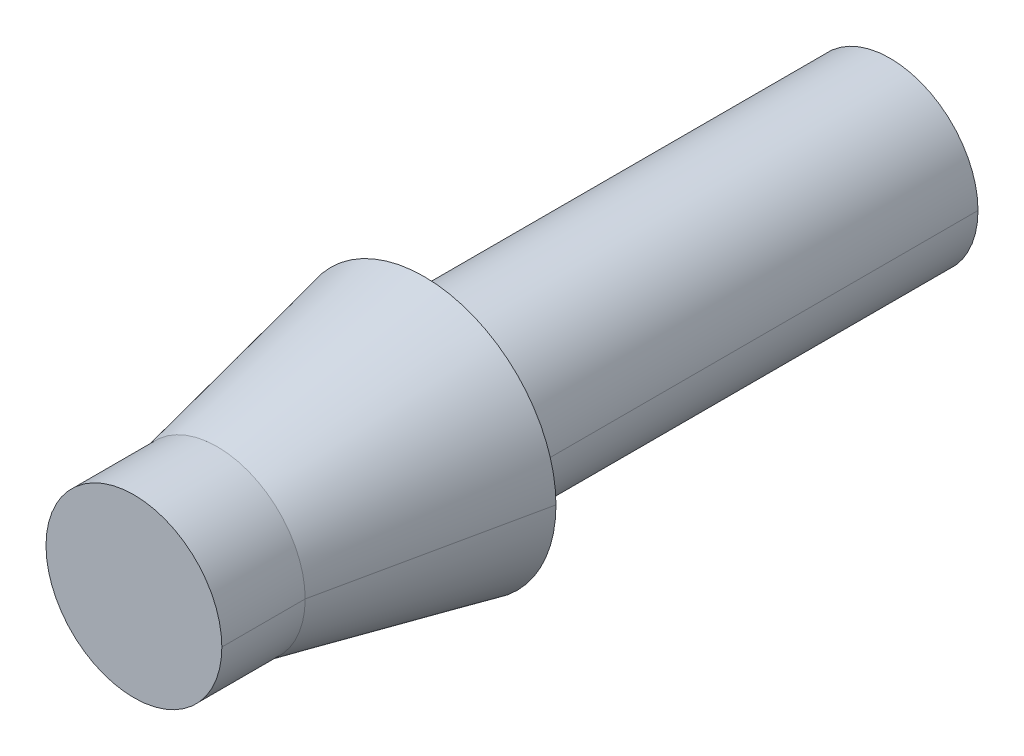
ISO-10303-21;
HEADER;
FILE_DESCRIPTION(('STEP AP214'),'2;1');
FILE_NAME('part.step','',(''),(''),'','','');
FILE_SCHEMA(('AUTOMOTIVE_DESIGN { 1 0 10303 214 1 1 1 1 }'));
ENDSEC;
DATA;
#1=APPLICATION_CONTEXT('core data for automotive mechanical design processes');
#2=APPLICATION_PROTOCOL_DEFINITION('international standard','automotive_design',2000,#1);
#3=PRODUCT_CONTEXT('',#1,'mechanical');
#4=PRODUCT('Part','Part','',(#3));
#5=PRODUCT_RELATED_PRODUCT_CATEGORY('part','',(#4));
#6=PRODUCT_DEFINITION_FORMATION('','',#4);
#7=PRODUCT_DEFINITION_CONTEXT('part definition',#1,'design');
#8=PRODUCT_DEFINITION('design','',#6,#7);
#9=PRODUCT_DEFINITION_SHAPE('','',#8);
#10=(LENGTH_UNIT() NAMED_UNIT(*) SI_UNIT(.MILLI.,.METRE.));
#11=(NAMED_UNIT(*) PLANE_ANGLE_UNIT() SI_UNIT($,.RADIAN.));
#12=(NAMED_UNIT(*) SI_UNIT($,.STERADIAN.) SOLID_ANGLE_UNIT());
#13=UNCERTAINTY_MEASURE_WITH_UNIT(LENGTH_MEASURE(1.E-05),#10,'distance_accuracy_value','');
#14=(GEOMETRIC_REPRESENTATION_CONTEXT(3) GLOBAL_UNCERTAINTY_ASSIGNED_CONTEXT((#13)) GLOBAL_UNIT_ASSIGNED_CONTEXT((#10,
#11,#12)) REPRESENTATION_CONTEXT('',''));
#15=CARTESIAN_POINT('',(0.,0.,0.));
#16=DIRECTION('',(0.,0.,1.));
#17=DIRECTION('',(1.,0.,0.));
#18=AXIS2_PLACEMENT_3D('',#15,#16,#17);
#19=CARTESIAN_POINT('',(0.,0.,56.5278615892912));
#20=DIRECTION('',(0.,0.,-1.));
#21=DIRECTION('',(-1.,0.,0.));
#22=AXIS2_PLACEMENT_3D('',#19,#20,#21);
#23=CYLINDRICAL_SURFACE('',#22,8.33333333333333);
#24=DIRECTION('',(0.,0.,-1.));
#25=VECTOR('',#24,1.);
#26=CARTESIAN_POINT('',(8.33333333333333,0.,56.5278615892912));
#27=LINE('',#26,#25);
#28=CARTESIAN_POINT('',(8.33333333333333,0.,29.0278615892912));
#29=VERTEX_POINT('',#28);
#30=CARTESIAN_POINT('',(8.33333333333333,0.,-15.1388050773755));
#31=VERTEX_POINT('',#30);
#32=EDGE_CURVE('P0_E129',#29,#31,#27,.T.);
#33=ORIENTED_EDGE('',*,*,#32,.F.);
#34=CARTESIAN_POINT('',(0.,0.,29.0278615892912));
#35=DIRECTION('',(0.,0.,1.));
#36=DIRECTION('',(1.,0.,0.));
#37=AXIS2_PLACEMENT_3D('',#34,#35,#36);
#38=CIRCLE('',#37,8.33333333333333);
#39=CARTESIAN_POINT('',(-8.33333333333333,0.,29.0278615892912));
#40=VERTEX_POINT('',#39);
#41=EDGE_CURVE('P0_E57',#40,#29,#38,.T.);
#42=ORIENTED_EDGE('',*,*,#41,.F.);
#43=DIRECTION('',(0.,0.,-1.));
#44=VECTOR('',#43,1.);
#45=CARTESIAN_POINT('',(-8.33333333333333,0.,56.5278615892912));
#46=LINE('',#45,#44);
#47=CARTESIAN_POINT('',(-8.33333333333333,0.,-15.1388050773755));
#48=VERTEX_POINT('',#47);
#49=EDGE_CURVE('P0_E136',#40,#48,#46,.T.);
#50=ORIENTED_EDGE('',*,*,#49,.T.);
#51=CARTESIAN_POINT('',(0.,0.,-15.1388050773755));
#52=DIRECTION('',(0.,0.,1.));
#53=DIRECTION('',(1.,0.,0.));
#54=AXIS2_PLACEMENT_3D('',#51,#52,#53);
#55=CIRCLE('',#54,8.33333333333333);
#56=EDGE_CURVE('P0_E11',#48,#31,#55,.T.);
#57=ORIENTED_EDGE('',*,*,#56,.T.);
#58=EDGE_LOOP('',(#33,#42,#50,#57));
#59=FACE_BOUND('',#58,.T.);
#60=ADVANCED_FACE('P0_F46',(#59),#23,.T.);
#61=CARTESIAN_POINT('',(0.,0.,-15.1388050773755));
#62=DIRECTION('',(0.,0.,1.));
#63=DIRECTION('',(1.,0.,0.));
#64=AXIS2_PLACEMENT_3D('',#61,#62,#63);
#65=PLANE('',#64);
#66=ORIENTED_EDGE('',*,*,#56,.F.);
#67=CARTESIAN_POINT('',(0.,0.,-15.1388050773755));
#68=DIRECTION('',(0.,0.,1.));
#69=DIRECTION('',(1.,0.,0.));
#70=AXIS2_PLACEMENT_3D('',#67,#68,#69);
#71=CIRCLE('',#70,8.33333333333333);
#72=EDGE_CURVE('P0_E50',#31,#48,#71,.T.);
#73=ORIENTED_EDGE('',*,*,#72,.F.);
#74=EDGE_LOOP('',(#66,#73));
#75=FACE_BOUND('',#74,.T.);
#76=ADVANCED_FACE('P0_F250',(#75),#65,.F.);
#77=CARTESIAN_POINT('',(0.,0.,29.0278615892912));
#78=DIRECTION('',(0.,0.,1.));
#79=DIRECTION('',(1.,0.,0.));
#80=AXIS2_PLACEMENT_3D('',#77,#78,#79);
#81=PLANE('',#80);
#82=ORIENTED_EDGE('',*,*,#41,.T.);
#83=CARTESIAN_POINT('',(0.,0.,29.0278615892912));
#84=DIRECTION('',(0.,0.,1.));
#85=DIRECTION('',(1.,0.,0.));
#86=AXIS2_PLACEMENT_3D('',#83,#84,#85);
#87=CIRCLE('',#86,8.33333333333333);
#88=EDGE_CURVE('P0_E122',#29,#40,#87,.T.);
#89=ORIENTED_EDGE('',*,*,#88,.T.);
#90=EDGE_LOOP('',(#82,#89));
#91=FACE_BOUND('',#90,.T.);
#92=CARTESIAN_POINT('',(0.,0.,29.0278615892912));
#93=DIRECTION('',(0.,0.,1.));
#94=DIRECTION('',(1.,0.,0.));
#95=AXIS2_PLACEMENT_3D('',#92,#93,#94);
#96=CIRCLE('',#95,12.5);
#97=CARTESIAN_POINT('',(12.5,0.,29.0278615892912));
#98=VERTEX_POINT('',#97);
#99=CARTESIAN_POINT('',(-12.5,0.,29.0278615892912));
#100=VERTEX_POINT('',#99);
#101=EDGE_CURVE('P0_E96',#98,#100,#96,.T.);
#102=ORIENTED_EDGE('',*,*,#101,.F.);
#103=CARTESIAN_POINT('',(0.,0.,29.0278615892912));
#104=DIRECTION('',(0.,0.,1.));
#105=DIRECTION('',(1.,0.,0.));
#106=AXIS2_PLACEMENT_3D('',#103,#104,#105);
#107=CIRCLE('',#106,12.5);
#108=EDGE_CURVE('P0_E142',#100,#98,#107,.T.);
#109=ORIENTED_EDGE('',*,*,#108,.F.);
#110=EDGE_LOOP('',(#102,#109));
#111=FACE_BOUND('',#110,.T.);
#112=ADVANCED_FACE('P0_F48',(#91,#111),#81,.F.);
#113=CARTESIAN_POINT('',(0.,0.,29.0278615892912));
#114=DIRECTION('',(0.,0.,-1.));
#115=DIRECTION('',(1.,0.,0.));
#116=AXIS2_PLACEMENT_3D('',#113,#114,#115);
#117=CONICAL_SURFACE('',#116,12.5,0.209439510239319);
#118=DIRECTION('',(-0.207911690817759,0.,-0.978147600733806));
#119=VECTOR('',#118,1.);
#120=CARTESIAN_POINT('',(-12.5,0.,29.0278615892912));
#121=LINE('',#120,#119);
#122=CARTESIAN_POINT('',(-8.33333333333333,0.,48.6304870454514));
#123=VERTEX_POINT('',#122);
#124=EDGE_CURVE('P0_E146',#123,#100,#121,.T.);
#125=ORIENTED_EDGE('',*,*,#124,.F.);
#126=CARTESIAN_POINT('',(0.,0.,48.6304870454514));
#127=DIRECTION('',(0.,0.,-1.));
#128=DIRECTION('',(-1.,0.,0.));
#129=AXIS2_PLACEMENT_3D('',#126,#127,#128);
#130=CIRCLE('',#129,8.33333333333333);
#131=CARTESIAN_POINT('',(8.33333333333333,0.,48.6304870454514));
#132=VERTEX_POINT('',#131);
#133=EDGE_CURVE('P0_E155',#123,#132,#130,.T.);
#134=ORIENTED_EDGE('',*,*,#133,.T.);
#135=DIRECTION('',(0.207911690817759,0.,-0.978147600733806));
#136=VECTOR('',#135,1.);
#137=CARTESIAN_POINT('',(12.5,0.,29.0278615892912));
#138=LINE('',#137,#136);
#139=EDGE_CURVE('P0_E145',#132,#98,#138,.T.);
#140=ORIENTED_EDGE('',*,*,#139,.T.);
#141=ORIENTED_EDGE('',*,*,#101,.T.);
#142=EDGE_LOOP('',(#125,#134,#140,#141));
#143=FACE_BOUND('',#142,.T.);
#144=ADVANCED_FACE('P0_F292',(#143),#117,.T.);
#145=CARTESIAN_POINT('',(0.,0.,56.5278615892912));
#146=DIRECTION('',(0.,0.,1.));
#147=DIRECTION('',(1.,0.,0.));
#148=AXIS2_PLACEMENT_3D('',#145,#146,#147);
#149=PLANE('',#148);
#150=CARTESIAN_POINT('',(0.,0.,56.5278615892912));
#151=DIRECTION('',(0.,0.,1.));
#152=DIRECTION('',(1.,0.,0.));
#153=AXIS2_PLACEMENT_3D('',#150,#151,#152);
#154=CIRCLE('',#153,8.33333333333333);
#155=CARTESIAN_POINT('',(-8.33333333333333,0.,56.5278615892912));
#156=VERTEX_POINT('',#155);
#157=CARTESIAN_POINT('',(8.33333333333333,0.,56.5278615892912));
#158=VERTEX_POINT('',#157);
#159=EDGE_CURVE('P0_E70',#156,#158,#154,.T.);
#160=ORIENTED_EDGE('',*,*,#159,.T.);
#161=CARTESIAN_POINT('',(0.,0.,56.5278615892912));
#162=DIRECTION('',(0.,0.,1.));
#163=DIRECTION('',(1.,0.,0.));
#164=AXIS2_PLACEMENT_3D('',#161,#162,#163);
#165=CIRCLE('',#164,8.33333333333333);
#166=EDGE_CURVE('P0_E154',#158,#156,#165,.T.);
#167=ORIENTED_EDGE('',*,*,#166,.T.);
#168=EDGE_LOOP('',(#160,#167));
#169=FACE_BOUND('',#168,.T.);
#170=ADVANCED_FACE('P0_F284',(#169),#149,.T.);
#171=CARTESIAN_POINT('',(0.,0.,56.5278615892912));
#172=DIRECTION('',(0.,0.,-1.));
#173=DIRECTION('',(-1.,0.,0.));
#174=AXIS2_PLACEMENT_3D('',#171,#172,#173);
#175=CYLINDRICAL_SURFACE('',#174,8.33333333333333);
#176=DIRECTION('',(0.,0.,-1.));
#177=VECTOR('',#176,1.);
#178=CARTESIAN_POINT('',(8.33333333333333,0.,56.5278615892912));
#179=LINE('',#178,#177);
#180=EDGE_CURVE('P0_E158',#158,#132,#179,.T.);
#181=ORIENTED_EDGE('',*,*,#180,.F.);
#182=ORIENTED_EDGE('',*,*,#159,.F.);
#183=DIRECTION('',(0.,0.,-1.));
#184=VECTOR('',#183,1.);
#185=CARTESIAN_POINT('',(-8.33333333333333,0.,56.5278615892912));
#186=LINE('',#185,#184);
#187=EDGE_CURVE('P0_E107',#156,#123,#186,.T.);
#188=ORIENTED_EDGE('',*,*,#187,.T.);
#189=CARTESIAN_POINT('',(0.,0.,48.6304870454514));
#190=DIRECTION('',(0.,0.,-1.));
#191=DIRECTION('',(-1.,0.,0.));
#192=AXIS2_PLACEMENT_3D('',#189,#190,#191);
#193=CIRCLE('',#192,8.33333333333333);
#194=EDGE_CURVE('P0_E148',#132,#123,#193,.T.);
#195=ORIENTED_EDGE('',*,*,#194,.F.);
#196=EDGE_LOOP('',(#181,#182,#188,#195));
#197=FACE_BOUND('',#196,.T.);
#198=ADVANCED_FACE('P0_F267',(#197),#175,.T.);
#199=CARTESIAN_POINT('',(0.,0.,56.5278615892912));
#200=DIRECTION('',(0.,0.,-1.));
#201=DIRECTION('',(-1.,0.,0.));
#202=AXIS2_PLACEMENT_3D('',#199,#200,#201);
#203=CYLINDRICAL_SURFACE('',#202,8.33333333333333);
#204=ORIENTED_EDGE('',*,*,#166,.F.);
#205=ORIENTED_EDGE('',*,*,#180,.T.);
#206=ORIENTED_EDGE('',*,*,#133,.F.);
#207=ORIENTED_EDGE('',*,*,#187,.F.);
#208=EDGE_LOOP('',(#204,#205,#206,#207));
#209=FACE_BOUND('',#208,.T.);
#210=ADVANCED_FACE('P0_F263',(#209),#203,.T.);
#211=CARTESIAN_POINT('',(0.,0.,29.0278615892912));
#212=DIRECTION('',(0.,0.,-1.));
#213=DIRECTION('',(1.,0.,0.));
#214=AXIS2_PLACEMENT_3D('',#211,#212,#213);
#215=CONICAL_SURFACE('',#214,12.5,0.209439510239319);
#216=ORIENTED_EDGE('',*,*,#194,.T.);
#217=ORIENTED_EDGE('',*,*,#124,.T.);
#218=ORIENTED_EDGE('',*,*,#108,.T.);
#219=ORIENTED_EDGE('',*,*,#139,.F.);
#220=EDGE_LOOP('',(#216,#217,#218,#219));
#221=FACE_BOUND('',#220,.T.);
#222=ADVANCED_FACE('P0_F242',(#221),#215,.T.);
#223=CARTESIAN_POINT('',(0.,0.,56.5278615892912));
#224=DIRECTION('',(0.,0.,-1.));
#225=DIRECTION('',(-1.,0.,0.));
#226=AXIS2_PLACEMENT_3D('',#223,#224,#225);
#227=CYLINDRICAL_SURFACE('',#226,8.33333333333333);
#228=ORIENTED_EDGE('',*,*,#88,.F.);
#229=ORIENTED_EDGE('',*,*,#32,.T.);
#230=ORIENTED_EDGE('',*,*,#72,.T.);
#231=ORIENTED_EDGE('',*,*,#49,.F.);
#232=EDGE_LOOP('',(#228,#229,#230,#231));
#233=FACE_BOUND('',#232,.T.);
#234=ADVANCED_FACE('P0_F135',(#233),#227,.T.);
#235=CLOSED_SHELL('',(#60,#76,#112,#144,#170,#198,#210,#222,#234));
#236=MANIFOLD_SOLID_BREP('P0_B2',#235);
#237=CARTESIAN_POINT('',(0.,0.,43.));
#238=DIRECTION('',(0.,0.,-1.));
#239=DIRECTION('',(-1.,0.,0.));
#240=AXIS2_PLACEMENT_3D('',#237,#238,#239);
#241=CYLINDRICAL_SURFACE('',#240,5.);
#242=DIRECTION('',(0.,0.,-1.));
#243=VECTOR('',#242,1.);
#244=CARTESIAN_POINT('',(5.,0.,43.));
#245=LINE('',#244,#243);
#246=CARTESIAN_POINT('',(5.,0.,26.5));
#247=VERTEX_POINT('',#246);
#248=CARTESIAN_POINT('',(5.,0.,0.));
#249=VERTEX_POINT('',#248);
#250=EDGE_CURVE('P1_E99',#247,#249,#245,.T.);
#251=ORIENTED_EDGE('',*,*,#250,.F.);
#252=CARTESIAN_POINT('',(0.,0.,26.5));
#253=DIRECTION('',(0.,0.,1.));
#254=DIRECTION('',(1.,0.,0.));
#255=AXIS2_PLACEMENT_3D('',#252,#253,#254);
#256=CIRCLE('',#255,5.);
#257=CARTESIAN_POINT('',(-5.,0.,26.5));
#258=VERTEX_POINT('',#257);
#259=EDGE_CURVE('P1_E26',#258,#247,#256,.T.);
#260=ORIENTED_EDGE('',*,*,#259,.F.);
#261=DIRECTION('',(0.,0.,-1.));
#262=VECTOR('',#261,1.);
#263=CARTESIAN_POINT('',(-5.,0.,43.));
#264=LINE('',#263,#262);
#265=CARTESIAN_POINT('',(-5.,0.,0.));
#266=VERTEX_POINT('',#265);
#267=EDGE_CURVE('P1_E106',#258,#266,#264,.T.);
#268=ORIENTED_EDGE('',*,*,#267,.T.);
#269=CARTESIAN_POINT('',(0.,0.,0.));
#270=DIRECTION('',(0.,0.,1.));
#271=DIRECTION('',(1.,0.,0.));
#272=AXIS2_PLACEMENT_3D('',#269,#270,#271);
#273=CIRCLE('',#272,5.);
#274=EDGE_CURVE('P1_E10',#266,#249,#273,.T.);
#275=ORIENTED_EDGE('',*,*,#274,.T.);
#276=EDGE_LOOP('',(#251,#260,#268,#275));
#277=FACE_BOUND('',#276,.T.);
#278=ADVANCED_FACE('P1_F15',(#277),#241,.T.);
#279=CARTESIAN_POINT('',(0.,0.,0.));
#280=DIRECTION('',(0.,0.,1.));
#281=DIRECTION('',(1.,0.,0.));
#282=AXIS2_PLACEMENT_3D('',#279,#280,#281);
#283=PLANE('',#282);
#284=ORIENTED_EDGE('',*,*,#274,.F.);
#285=CARTESIAN_POINT('',(0.,0.,0.));
#286=DIRECTION('',(0.,0.,1.));
#287=DIRECTION('',(1.,0.,0.));
#288=AXIS2_PLACEMENT_3D('',#285,#286,#287);
#289=CIRCLE('',#288,5.);
#290=EDGE_CURVE('P1_E19',#249,#266,#289,.T.);
#291=ORIENTED_EDGE('',*,*,#290,.F.);
#292=EDGE_LOOP('',(#284,#291));
#293=FACE_BOUND('',#292,.T.);
#294=ADVANCED_FACE('P1_F228',(#293),#283,.F.);
#295=CARTESIAN_POINT('',(0.,0.,26.5));
#296=DIRECTION('',(0.,0.,1.));
#297=DIRECTION('',(1.,0.,0.));
#298=AXIS2_PLACEMENT_3D('',#295,#296,#297);
#299=PLANE('',#298);
#300=ORIENTED_EDGE('',*,*,#259,.T.);
#301=CARTESIAN_POINT('',(0.,0.,26.5));
#302=DIRECTION('',(0.,0.,1.));
#303=DIRECTION('',(1.,0.,0.));
#304=AXIS2_PLACEMENT_3D('',#301,#302,#303);
#305=CIRCLE('',#304,5.);
#306=EDGE_CURVE('P1_E92',#247,#258,#305,.T.);
#307=ORIENTED_EDGE('',*,*,#306,.T.);
#308=EDGE_LOOP('',(#300,#307));
#309=FACE_BOUND('',#308,.T.);
#310=CARTESIAN_POINT('',(0.,0.,26.5));
#311=DIRECTION('',(0.,0.,1.));
#312=DIRECTION('',(1.,0.,0.));
#313=AXIS2_PLACEMENT_3D('',#310,#311,#312);
#314=CIRCLE('',#313,7.5);
#315=CARTESIAN_POINT('',(7.5,0.,26.5));
#316=VERTEX_POINT('',#315);
#317=CARTESIAN_POINT('',(-7.5,0.,26.5));
#318=VERTEX_POINT('',#317);
#319=EDGE_CURVE('P1_E66',#316,#318,#314,.T.);
#320=ORIENTED_EDGE('',*,*,#319,.F.);
#321=CARTESIAN_POINT('',(0.,0.,26.5));
#322=DIRECTION('',(0.,0.,1.));
#323=DIRECTION('',(1.,0.,0.));
#324=AXIS2_PLACEMENT_3D('',#321,#322,#323);
#325=CIRCLE('',#324,7.5);
#326=EDGE_CURVE('P1_E113',#318,#316,#325,.T.);
#327=ORIENTED_EDGE('',*,*,#326,.F.);
#328=EDGE_LOOP('',(#320,#327));
#329=FACE_BOUND('',#328,.T.);
#330=ADVANCED_FACE('P1_F17',(#309,#329),#299,.F.);
#331=CARTESIAN_POINT('',(0.,0.,26.5));
#332=DIRECTION('',(0.,0.,-1.));
#333=DIRECTION('',(1.,0.,0.));
#334=AXIS2_PLACEMENT_3D('',#331,#332,#333);
#335=CONICAL_SURFACE('',#334,7.5,0.209439510239319);
#336=DIRECTION('',(-0.207911690817759,0.,-0.978147600733806));
#337=VECTOR('',#336,1.);
#338=CARTESIAN_POINT('',(-7.5,0.,26.5));
#339=LINE('',#338,#337);
#340=CARTESIAN_POINT('',(-5.,0.,38.2615752736962));
#341=VERTEX_POINT('',#340);
#342=EDGE_CURVE('P1_E117',#341,#318,#339,.T.);
#343=ORIENTED_EDGE('',*,*,#342,.F.);
#344=CARTESIAN_POINT('',(0.,0.,38.2615752736962));
#345=DIRECTION('',(0.,0.,-1.));
#346=DIRECTION('',(-1.,0.,0.));
#347=AXIS2_PLACEMENT_3D('',#344,#345,#346);
#348=CIRCLE('',#347,5.);
#349=CARTESIAN_POINT('',(5.,0.,38.2615752736962));
#350=VERTEX_POINT('',#349);
#351=EDGE_CURVE('P1_E126',#341,#350,#348,.T.);
#352=ORIENTED_EDGE('',*,*,#351,.T.);
#353=DIRECTION('',(0.207911690817759,0.,-0.978147600733806));
#354=VECTOR('',#353,1.);
#355=CARTESIAN_POINT('',(7.5,0.,26.5));
#356=LINE('',#355,#354);
#357=EDGE_CURVE('P1_E116',#350,#316,#356,.T.);
#358=ORIENTED_EDGE('',*,*,#357,.T.);
#359=ORIENTED_EDGE('',*,*,#319,.T.);
#360=EDGE_LOOP('',(#343,#352,#358,#359));
#361=FACE_BOUND('',#360,.T.);
#362=ADVANCED_FACE('P1_F270',(#361),#335,.T.);
#363=CARTESIAN_POINT('',(0.,0.,43.));
#364=DIRECTION('',(0.,0.,1.));
#365=DIRECTION('',(1.,0.,0.));
#366=AXIS2_PLACEMENT_3D('',#363,#364,#365);
#367=PLANE('',#366);
#368=CARTESIAN_POINT('',(0.,0.,43.));
#369=DIRECTION('',(0.,0.,1.));
#370=DIRECTION('',(1.,0.,0.));
#371=AXIS2_PLACEMENT_3D('',#368,#369,#370);
#372=CIRCLE('',#371,5.);
#373=CARTESIAN_POINT('',(-5.,0.,43.));
#374=VERTEX_POINT('',#373);
#375=CARTESIAN_POINT('',(5.,0.,43.));
#376=VERTEX_POINT('',#375);
#377=EDGE_CURVE('P1_E40',#374,#376,#372,.T.);
#378=ORIENTED_EDGE('',*,*,#377,.T.);
#379=CARTESIAN_POINT('',(0.,0.,43.));
#380=DIRECTION('',(0.,0.,1.));
#381=DIRECTION('',(1.,0.,0.));
#382=AXIS2_PLACEMENT_3D('',#379,#380,#381);
#383=CIRCLE('',#382,5.);
#384=EDGE_CURVE('P1_E125',#376,#374,#383,.T.);
#385=ORIENTED_EDGE('',*,*,#384,.T.);
#386=EDGE_LOOP('',(#378,#385));
#387=FACE_BOUND('',#386,.T.);
#388=ADVANCED_FACE('P1_F262',(#387),#367,.T.);
#389=CARTESIAN_POINT('',(0.,0.,43.));
#390=DIRECTION('',(0.,0.,-1.));
#391=DIRECTION('',(-1.,0.,0.));
#392=AXIS2_PLACEMENT_3D('',#389,#390,#391);
#393=CYLINDRICAL_SURFACE('',#392,5.);
#394=DIRECTION('',(0.,0.,-1.));
#395=VECTOR('',#394,1.);
#396=CARTESIAN_POINT('',(5.,0.,43.));
#397=LINE('',#396,#395);
#398=EDGE_CURVE('P1_E129',#376,#350,#397,.T.);
#399=ORIENTED_EDGE('',*,*,#398,.F.);
#400=ORIENTED_EDGE('',*,*,#377,.F.);
#401=DIRECTION('',(0.,0.,-1.));
#402=VECTOR('',#401,1.);
#403=CARTESIAN_POINT('',(-5.,0.,43.));
#404=LINE('',#403,#402);
#405=EDGE_CURVE('P1_E77',#374,#341,#404,.T.);
#406=ORIENTED_EDGE('',*,*,#405,.T.);
#407=CARTESIAN_POINT('',(0.,0.,38.2615752736962));
#408=DIRECTION('',(0.,0.,-1.));
#409=DIRECTION('',(-1.,0.,0.));
#410=AXIS2_PLACEMENT_3D('',#407,#408,#409);
#411=CIRCLE('',#410,5.);
#412=EDGE_CURVE('P1_E119',#350,#341,#411,.T.);
#413=ORIENTED_EDGE('',*,*,#412,.F.);
#414=EDGE_LOOP('',(#399,#400,#406,#413));
#415=FACE_BOUND('',#414,.T.);
#416=ADVANCED_FACE('P1_F245',(#415),#393,.T.);
#417=CARTESIAN_POINT('',(0.,0.,43.));
#418=DIRECTION('',(0.,0.,-1.));
#419=DIRECTION('',(-1.,0.,0.));
#420=AXIS2_PLACEMENT_3D('',#417,#418,#419);
#421=CYLINDRICAL_SURFACE('',#420,5.);
#422=ORIENTED_EDGE('',*,*,#384,.F.);
#423=ORIENTED_EDGE('',*,*,#398,.T.);
#424=ORIENTED_EDGE('',*,*,#351,.F.);
#425=ORIENTED_EDGE('',*,*,#405,.F.);
#426=EDGE_LOOP('',(#422,#423,#424,#425));
#427=FACE_BOUND('',#426,.T.);
#428=ADVANCED_FACE('P1_F241',(#427),#421,.T.);
#429=CARTESIAN_POINT('',(0.,0.,26.5));
#430=DIRECTION('',(0.,0.,-1.));
#431=DIRECTION('',(1.,0.,0.));
#432=AXIS2_PLACEMENT_3D('',#429,#430,#431);
#433=CONICAL_SURFACE('',#432,7.5,0.209439510239319);
#434=ORIENTED_EDGE('',*,*,#412,.T.);
#435=ORIENTED_EDGE('',*,*,#342,.T.);
#436=ORIENTED_EDGE('',*,*,#326,.T.);
#437=ORIENTED_EDGE('',*,*,#357,.F.);
#438=EDGE_LOOP('',(#434,#435,#436,#437));
#439=FACE_BOUND('',#438,.T.);
#440=ADVANCED_FACE('P1_F220',(#439),#433,.T.);
#441=CARTESIAN_POINT('',(0.,0.,43.));
#442=DIRECTION('',(0.,0.,-1.));
#443=DIRECTION('',(-1.,0.,0.));
#444=AXIS2_PLACEMENT_3D('',#441,#442,#443);
#445=CYLINDRICAL_SURFACE('',#444,5.);
#446=ORIENTED_EDGE('',*,*,#306,.F.);
#447=ORIENTED_EDGE('',*,*,#250,.T.);
#448=ORIENTED_EDGE('',*,*,#290,.T.);
#449=ORIENTED_EDGE('',*,*,#267,.F.);
#450=EDGE_LOOP('',(#446,#447,#448,#449));
#451=FACE_BOUND('',#450,.T.);
#452=ADVANCED_FACE('P1_F105',(#451),#445,.T.);
#453=CLOSED_SHELL('',(#278,#294,#330,#362,#388,#416,#428,#440,#452));
#454=MANIFOLD_SOLID_BREP('P1_B1',#453);
#455=ADVANCED_BREP_SHAPE_REPRESENTATION('',(#18,#236,#454),#14);
#456=SHAPE_DEFINITION_REPRESENTATION(#9,#455);
ENDSEC;
END-ISO-10303-21;
